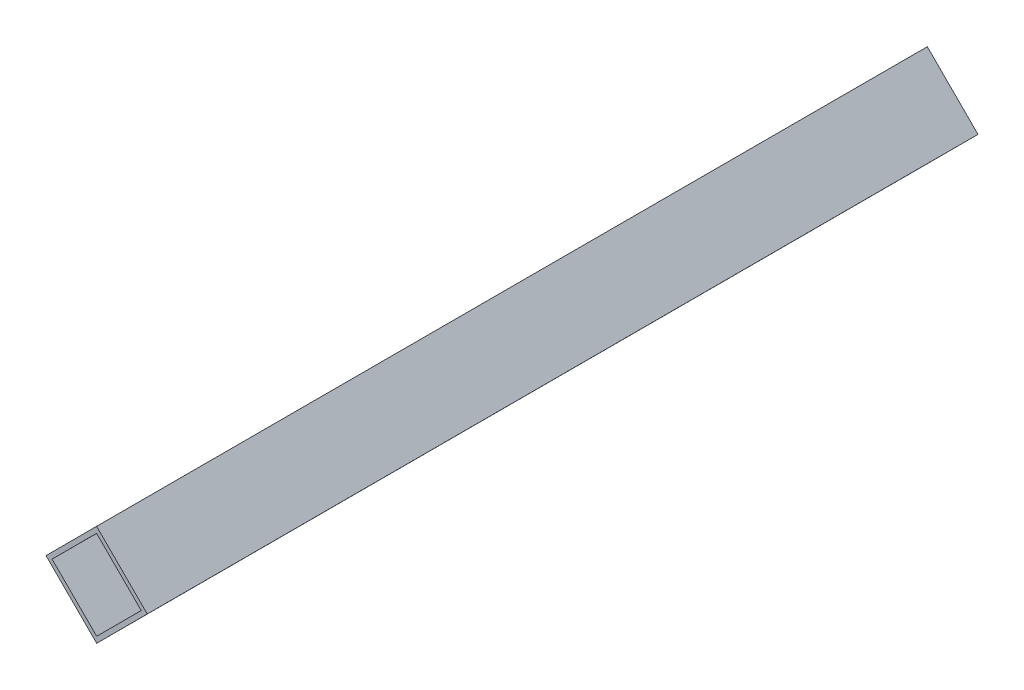
ISO-10303-21;
HEADER;
FILE_DESCRIPTION(('STEP AP214'),'2;1');
FILE_NAME('part.step','',(''),(''),'','','');
FILE_SCHEMA(('AUTOMOTIVE_DESIGN { 1 0 10303 214 1 1 1 1 }'));
ENDSEC;
DATA;
#1=APPLICATION_CONTEXT('core data for automotive mechanical design processes');
#2=APPLICATION_PROTOCOL_DEFINITION('international standard','automotive_design',2000,#1);
#3=PRODUCT_CONTEXT('',#1,'mechanical');
#4=PRODUCT('Part','Part','',(#3));
#5=PRODUCT_RELATED_PRODUCT_CATEGORY('part','',(#4));
#6=PRODUCT_DEFINITION_FORMATION('','',#4);
#7=PRODUCT_DEFINITION_CONTEXT('part definition',#1,'design');
#8=PRODUCT_DEFINITION('design','',#6,#7);
#9=PRODUCT_DEFINITION_SHAPE('','',#8);
#10=(LENGTH_UNIT() NAMED_UNIT(*) SI_UNIT(.MILLI.,.METRE.));
#11=(NAMED_UNIT(*) PLANE_ANGLE_UNIT() SI_UNIT($,.RADIAN.));
#12=(NAMED_UNIT(*) SI_UNIT($,.STERADIAN.) SOLID_ANGLE_UNIT());
#13=UNCERTAINTY_MEASURE_WITH_UNIT(LENGTH_MEASURE(1.E-05),#10,'distance_accuracy_value','');
#14=(GEOMETRIC_REPRESENTATION_CONTEXT(3) GLOBAL_UNCERTAINTY_ASSIGNED_CONTEXT((#13)) GLOBAL_UNIT_ASSIGNED_CONTEXT((#10,
#11,#12)) REPRESENTATION_CONTEXT('',''));
#15=CARTESIAN_POINT('',(0.,0.,0.));
#16=DIRECTION('',(0.,0.,1.));
#17=DIRECTION('',(1.,0.,0.));
#18=AXIS2_PLACEMENT_3D('',#15,#16,#17);
#19=CARTESIAN_POINT('',(0.,0.,290.));
#20=DIRECTION('',(0.,0.,1.));
#21=DIRECTION('',(1.,0.,0.));
#22=AXIS2_PLACEMENT_3D('',#19,#20,#21);
#23=PLANE('',#22);
#24=DIRECTION('',(-0.70646122875546,-0.707751744798503,0.));
#25=VECTOR('',#24,1.);
#26=CARTESIAN_POINT('',(0.,0.,290.));
#27=LINE('',#26,#25);
#28=CARTESIAN_POINT('',(0.,0.,290.));
#29=VERTEX_POINT('',#28);
#30=CARTESIAN_POINT('',(-17.6615307188865,-17.6937936199626,290.));
#31=VERTEX_POINT('',#30);
#32=EDGE_CURVE('E135',#29,#31,#27,.T.);
#33=ORIENTED_EDGE('',*,*,#32,.T.);
#34=DIRECTION('',(0.707751744798503,-0.70646122875546,0.));
#35=VECTOR('',#34,1.);
#36=CARTESIAN_POINT('',(-17.6615307188865,-17.6937936199626,290.));
#37=LINE('',#36,#35);
#38=CARTESIAN_POINT('',(0.0322629010760627,-35.3553243388491,290.));
#39=VERTEX_POINT('',#38);
#40=EDGE_CURVE('E138',#31,#39,#37,.T.);
#41=ORIENTED_EDGE('',*,*,#40,.T.);
#42=DIRECTION('',(0.70646122875546,0.707751744798503,0.));
#43=VECTOR('',#42,1.);
#44=CARTESIAN_POINT('',(17.6937936199626,-17.6615307188865,290.));
#45=LINE('',#44,#43);
#46=CARTESIAN_POINT('',(17.6937936199626,-17.6615307188865,290.));
#47=VERTEX_POINT('',#46);
#48=EDGE_CURVE('E141',#39,#47,#45,.T.);
#49=ORIENTED_EDGE('',*,*,#48,.T.);
#50=DIRECTION('',(-0.707751744798503,0.70646122875546,0.));
#51=VECTOR('',#50,1.);
#52=CARTESIAN_POINT('',(0.,0.,290.));
#53=LINE('',#52,#51);
#54=EDGE_CURVE('E143',#47,#29,#53,.T.);
#55=ORIENTED_EDGE('',*,*,#54,.T.);
#56=EDGE_LOOP('',(#33,#41,#49,#55));
#57=FACE_BOUND('',#56,.T.);
#58=DIRECTION('',(-0.706461228755461,-0.707751744798503,0.));
#59=VECTOR('',#58,1.);
#60=CARTESIAN_POINT('',(0.00193577406456353,-2.12131946033095,290.));
#61=LINE('',#60,#59);
#62=CARTESIAN_POINT('',(0.00193577406456353,-2.12131946033095,290.));
#63=VERTEX_POINT('',#62);
#64=CARTESIAN_POINT('',(-15.5402112585556,-17.691857845898,290.));
#65=VERTEX_POINT('',#64);
#66=EDGE_CURVE('E107',#63,#65,#61,.T.);
#67=ORIENTED_EDGE('',*,*,#66,.F.);
#68=DIRECTION('',(-0.707751744798503,0.70646122875546,0.));
#69=VECTOR('',#68,1.);
#70=CARTESIAN_POINT('',(0.00193577406456353,-2.12131946033095,290.));
#71=LINE('',#70,#69);
#72=CARTESIAN_POINT('',(15.5724741596316,-17.6634664929511,290.));
#73=VERTEX_POINT('',#72);
#74=EDGE_CURVE('E99',#73,#63,#71,.T.);
#75=ORIENTED_EDGE('',*,*,#74,.F.);
#76=DIRECTION('',(0.70646122875546,0.707751744798503,0.));
#77=VECTOR('',#76,1.);
#78=CARTESIAN_POINT('',(15.5724741596316,-17.6634664929511,290.));
#79=LINE('',#78,#77);
#80=CARTESIAN_POINT('',(0.0303271270114952,-33.2340048785181,290.));
#81=VERTEX_POINT('',#80);
#82=EDGE_CURVE('E121',#81,#73,#79,.T.);
#83=ORIENTED_EDGE('',*,*,#82,.F.);
#84=DIRECTION('',(0.707751744798503,-0.70646122875546,0.));
#85=VECTOR('',#84,1.);
#86=CARTESIAN_POINT('',(-15.5402112585556,-17.691857845898,290.));
#87=LINE('',#86,#85);
#88=EDGE_CURVE('E119',#65,#81,#87,.T.);
#89=ORIENTED_EDGE('',*,*,#88,.F.);
#90=EDGE_LOOP('',(#67,#75,#83,#89));
#91=FACE_BOUND('',#90,.T.);
#92=ADVANCED_FACE('F34',(#57,#91),#23,.T.);
#93=CARTESIAN_POINT('',(0.,0.,0.));
#94=DIRECTION('',(0.,0.,1.));
#95=DIRECTION('',(1.,0.,0.));
#96=AXIS2_PLACEMENT_3D('',#93,#94,#95);
#97=PLANE('',#96);
#98=DIRECTION('',(-0.70646122875546,-0.707751744798503,0.));
#99=VECTOR('',#98,1.);
#100=CARTESIAN_POINT('',(0.,0.,0.));
#101=LINE('',#100,#99);
#102=CARTESIAN_POINT('',(0.,0.,0.));
#103=VERTEX_POINT('',#102);
#104=CARTESIAN_POINT('',(-17.6615307188865,-17.6937936199626,0.));
#105=VERTEX_POINT('',#104);
#106=EDGE_CURVE('E115',#103,#105,#101,.T.);
#107=ORIENTED_EDGE('',*,*,#106,.F.);
#108=DIRECTION('',(-0.707751744798503,0.70646122875546,0.));
#109=VECTOR('',#108,1.);
#110=CARTESIAN_POINT('',(0.,0.,0.));
#111=LINE('',#110,#109);
#112=CARTESIAN_POINT('',(17.6937936199626,-17.6615307188865,0.));
#113=VERTEX_POINT('',#112);
#114=EDGE_CURVE('E139',#113,#103,#111,.T.);
#115=ORIENTED_EDGE('',*,*,#114,.F.);
#116=DIRECTION('',(0.70646122875546,0.707751744798503,0.));
#117=VECTOR('',#116,1.);
#118=CARTESIAN_POINT('',(17.6937936199626,-17.6615307188865,0.));
#119=LINE('',#118,#117);
#120=CARTESIAN_POINT('',(0.0322629010760627,-35.3553243388491,0.));
#121=VERTEX_POINT('',#120);
#122=EDGE_CURVE('E150',#121,#113,#119,.T.);
#123=ORIENTED_EDGE('',*,*,#122,.F.);
#124=DIRECTION('',(0.707751744798503,-0.70646122875546,0.));
#125=VECTOR('',#124,1.);
#126=CARTESIAN_POINT('',(-17.6615307188865,-17.6937936199626,0.));
#127=LINE('',#126,#125);
#128=EDGE_CURVE('E148',#105,#121,#127,.T.);
#129=ORIENTED_EDGE('',*,*,#128,.F.);
#130=EDGE_LOOP('',(#107,#115,#123,#129));
#131=FACE_BOUND('',#130,.T.);
#132=DIRECTION('',(-0.707751744798503,0.70646122875546,0.));
#133=VECTOR('',#132,1.);
#134=CARTESIAN_POINT('',(0.00193577406456353,-2.12131946033095,0.));
#135=LINE('',#134,#133);
#136=CARTESIAN_POINT('',(15.5724741596316,-17.6634664929511,0.));
#137=VERTEX_POINT('',#136);
#138=CARTESIAN_POINT('',(0.00193577406456353,-2.12131946033095,0.));
#139=VERTEX_POINT('',#138);
#140=EDGE_CURVE('E57',#137,#139,#135,.T.);
#141=ORIENTED_EDGE('',*,*,#140,.T.);
#142=DIRECTION('',(-0.706461228755461,-0.707751744798503,0.));
#143=VECTOR('',#142,1.);
#144=CARTESIAN_POINT('',(0.00193577406456353,-2.12131946033095,0.));
#145=LINE('',#144,#143);
#146=CARTESIAN_POINT('',(-15.5402112585556,-17.691857845898,0.));
#147=VERTEX_POINT('',#146);
#148=EDGE_CURVE('E114',#139,#147,#145,.T.);
#149=ORIENTED_EDGE('',*,*,#148,.T.);
#150=DIRECTION('',(0.707751744798503,-0.70646122875546,0.));
#151=VECTOR('',#150,1.);
#152=CARTESIAN_POINT('',(-15.5402112585556,-17.691857845898,0.));
#153=LINE('',#152,#151);
#154=CARTESIAN_POINT('',(0.0303271270114987,-33.2340048785181,0.));
#155=VERTEX_POINT('',#154);
#156=EDGE_CURVE('E127',#147,#155,#153,.T.);
#157=ORIENTED_EDGE('',*,*,#156,.T.);
#158=DIRECTION('',(0.70646122875546,0.707751744798503,0.));
#159=VECTOR('',#158,1.);
#160=CARTESIAN_POINT('',(15.5724741596316,-17.6634664929511,0.));
#161=LINE('',#160,#159);
#162=EDGE_CURVE('E108',#155,#137,#161,.T.);
#163=ORIENTED_EDGE('',*,*,#162,.T.);
#164=EDGE_LOOP('',(#141,#149,#157,#163));
#165=FACE_BOUND('',#164,.T.);
#166=ADVANCED_FACE('F168',(#131,#165),#97,.F.);
#167=CARTESIAN_POINT('',(0.,0.,290.));
#168=DIRECTION('',(0.707751744798503,-0.70646122875546,0.));
#169=DIRECTION('',(0.70646122875546,0.707751744798503,0.));
#170=AXIS2_PLACEMENT_3D('',#167,#168,#169);
#171=PLANE('',#170);
#172=ORIENTED_EDGE('',*,*,#106,.T.);
#173=DIRECTION('',(0.,0.,-1.));
#174=VECTOR('',#173,1.);
#175=CARTESIAN_POINT('',(-17.6615307188865,-17.6937936199626,290.));
#176=LINE('',#175,#174);
#177=EDGE_CURVE('E11',#31,#105,#176,.T.);
#178=ORIENTED_EDGE('',*,*,#177,.F.);
#179=ORIENTED_EDGE('',*,*,#32,.F.);
#180=DIRECTION('',(0.,0.,-1.));
#181=VECTOR('',#180,1.);
#182=CARTESIAN_POINT('',(0.,0.,290.));
#183=LINE('',#182,#181);
#184=EDGE_CURVE('E145',#29,#103,#183,.T.);
#185=ORIENTED_EDGE('',*,*,#184,.T.);
#186=EDGE_LOOP('',(#172,#178,#179,#185));
#187=FACE_BOUND('',#186,.T.);
#188=ADVANCED_FACE('F36',(#187),#171,.F.);
#189=CARTESIAN_POINT('',(-17.6615307188865,-17.6937936199626,290.));
#190=DIRECTION('',(0.70646122875546,0.707751744798503,0.));
#191=DIRECTION('',(-0.707751744798503,0.70646122875546,0.));
#192=AXIS2_PLACEMENT_3D('',#189,#190,#191);
#193=PLANE('',#192);
#194=ORIENTED_EDGE('',*,*,#128,.T.);
#195=DIRECTION('',(0.,0.,-1.));
#196=VECTOR('',#195,1.);
#197=CARTESIAN_POINT('',(0.0322629010760627,-35.3553243388491,290.));
#198=LINE('',#197,#196);
#199=EDGE_CURVE('E42',#39,#121,#198,.T.);
#200=ORIENTED_EDGE('',*,*,#199,.F.);
#201=ORIENTED_EDGE('',*,*,#40,.F.);
#202=ORIENTED_EDGE('',*,*,#177,.T.);
#203=EDGE_LOOP('',(#194,#200,#201,#202));
#204=FACE_BOUND('',#203,.T.);
#205=ADVANCED_FACE('F178',(#204),#193,.F.);
#206=CARTESIAN_POINT('',(17.6937936199626,-17.6615307188865,290.));
#207=DIRECTION('',(-0.707751744798503,0.70646122875546,0.));
#208=DIRECTION('',(-0.70646122875546,-0.707751744798503,0.));
#209=AXIS2_PLACEMENT_3D('',#206,#207,#208);
#210=PLANE('',#209);
#211=ORIENTED_EDGE('',*,*,#122,.T.);
#212=DIRECTION('',(0.,0.,-1.));
#213=VECTOR('',#212,1.);
#214=CARTESIAN_POINT('',(17.6937936199626,-17.6615307188865,290.));
#215=LINE('',#214,#213);
#216=EDGE_CURVE('E155',#47,#113,#215,.T.);
#217=ORIENTED_EDGE('',*,*,#216,.F.);
#218=ORIENTED_EDGE('',*,*,#48,.F.);
#219=ORIENTED_EDGE('',*,*,#199,.T.);
#220=EDGE_LOOP('',(#211,#217,#218,#219));
#221=FACE_BOUND('',#220,.T.);
#222=ADVANCED_FACE('F162',(#221),#210,.F.);
#223=CARTESIAN_POINT('',(0.,0.,290.));
#224=DIRECTION('',(-0.70646122875546,-0.707751744798503,0.));
#225=DIRECTION('',(0.707751744798503,-0.70646122875546,0.));
#226=AXIS2_PLACEMENT_3D('',#223,#224,#225);
#227=PLANE('',#226);
#228=ORIENTED_EDGE('',*,*,#114,.T.);
#229=ORIENTED_EDGE('',*,*,#184,.F.);
#230=ORIENTED_EDGE('',*,*,#54,.F.);
#231=ORIENTED_EDGE('',*,*,#216,.T.);
#232=EDGE_LOOP('',(#228,#229,#230,#231));
#233=FACE_BOUND('',#232,.T.);
#234=ADVANCED_FACE('F172',(#233),#227,.F.);
#235=CARTESIAN_POINT('',(0.00193577406456353,-2.12131946033095,290.));
#236=DIRECTION('',(-0.70646122875546,-0.707751744798503,0.));
#237=DIRECTION('',(0.707751744798503,-0.70646122875546,0.));
#238=AXIS2_PLACEMENT_3D('',#235,#236,#237);
#239=PLANE('',#238);
#240=ORIENTED_EDGE('',*,*,#140,.F.);
#241=DIRECTION('',(0.,0.,-1.));
#242=VECTOR('',#241,1.);
#243=CARTESIAN_POINT('',(15.5724741596316,-17.6634664929511,290.));
#244=LINE('',#243,#242);
#245=EDGE_CURVE('E103',#73,#137,#244,.T.);
#246=ORIENTED_EDGE('',*,*,#245,.F.);
#247=ORIENTED_EDGE('',*,*,#74,.T.);
#248=DIRECTION('',(0.,0.,-1.));
#249=VECTOR('',#248,1.);
#250=CARTESIAN_POINT('',(0.00193577406456353,-2.12131946033095,290.));
#251=LINE('',#250,#249);
#252=EDGE_CURVE('E102',#63,#139,#251,.T.);
#253=ORIENTED_EDGE('',*,*,#252,.T.);
#254=EDGE_LOOP('',(#240,#246,#247,#253));
#255=FACE_BOUND('',#254,.T.);
#256=ADVANCED_FACE('F101',(#255),#239,.T.);
#257=CARTESIAN_POINT('',(0.00193577406456353,-2.12131946033095,290.));
#258=DIRECTION('',(0.707751744798503,-0.706461228755461,0.));
#259=DIRECTION('',(0.706461228755461,0.707751744798503,0.));
#260=AXIS2_PLACEMENT_3D('',#257,#258,#259);
#261=PLANE('',#260);
#262=ORIENTED_EDGE('',*,*,#148,.F.);
#263=ORIENTED_EDGE('',*,*,#252,.F.);
#264=ORIENTED_EDGE('',*,*,#66,.T.);
#265=DIRECTION('',(0.,0.,-1.));
#266=VECTOR('',#265,1.);
#267=CARTESIAN_POINT('',(-15.5402112585556,-17.691857845898,290.));
#268=LINE('',#267,#266);
#269=EDGE_CURVE('E116',#65,#147,#268,.T.);
#270=ORIENTED_EDGE('',*,*,#269,.T.);
#271=EDGE_LOOP('',(#262,#263,#264,#270));
#272=FACE_BOUND('',#271,.T.);
#273=ADVANCED_FACE('F111',(#272),#261,.T.);
#274=CARTESIAN_POINT('',(-15.5402112585556,-17.691857845898,290.));
#275=DIRECTION('',(0.70646122875546,0.707751744798503,0.));
#276=DIRECTION('',(-0.707751744798503,0.70646122875546,0.));
#277=AXIS2_PLACEMENT_3D('',#274,#275,#276);
#278=PLANE('',#277);
#279=ORIENTED_EDGE('',*,*,#156,.F.);
#280=ORIENTED_EDGE('',*,*,#269,.F.);
#281=ORIENTED_EDGE('',*,*,#88,.T.);
#282=DIRECTION('',(0.,0.,-1.));
#283=VECTOR('',#282,1.);
#284=CARTESIAN_POINT('',(0.0303271270114987,-33.2340048785181,290.));
#285=LINE('',#284,#283);
#286=EDGE_CURVE('E49',#81,#155,#285,.T.);
#287=ORIENTED_EDGE('',*,*,#286,.T.);
#288=EDGE_LOOP('',(#279,#280,#281,#287));
#289=FACE_BOUND('',#288,.T.);
#290=ADVANCED_FACE('F201',(#289),#278,.T.);
#291=CARTESIAN_POINT('',(15.5724741596316,-17.6634664929511,290.));
#292=DIRECTION('',(-0.707751744798503,0.70646122875546,0.));
#293=DIRECTION('',(-0.70646122875546,-0.707751744798503,0.));
#294=AXIS2_PLACEMENT_3D('',#291,#292,#293);
#295=PLANE('',#294);
#296=ORIENTED_EDGE('',*,*,#162,.F.);
#297=ORIENTED_EDGE('',*,*,#286,.F.);
#298=ORIENTED_EDGE('',*,*,#82,.T.);
#299=ORIENTED_EDGE('',*,*,#245,.T.);
#300=EDGE_LOOP('',(#296,#297,#298,#299));
#301=FACE_BOUND('',#300,.T.);
#302=ADVANCED_FACE('F205',(#301),#295,.T.);
#303=CLOSED_SHELL('',(#92,#166,#188,#205,#222,#234,#256,#273,#290,#302));
#304=MANIFOLD_SOLID_BREP('B2',#303);
#305=ADVANCED_BREP_SHAPE_REPRESENTATION('',(#18,#304),#14);
#306=SHAPE_DEFINITION_REPRESENTATION(#9,#305);
ENDSEC;
END-ISO-10303-21;
